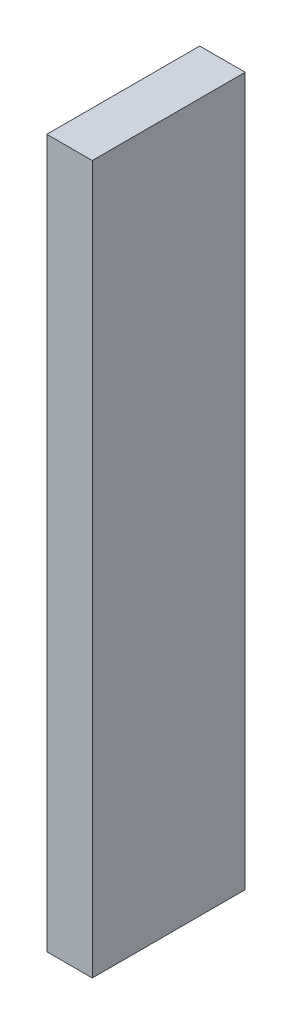
ISO-10303-21;
HEADER;
FILE_DESCRIPTION(('STEP AP214'),'2;1');
FILE_NAME('part.step','',(''),(''),'','','');
FILE_SCHEMA(('AUTOMOTIVE_DESIGN { 1 0 10303 214 1 1 1 1 }'));
ENDSEC;
DATA;
#1=APPLICATION_CONTEXT('core data for automotive mechanical design processes');
#2=APPLICATION_PROTOCOL_DEFINITION('international standard','automotive_design',2000,#1);
#3=PRODUCT_CONTEXT('',#1,'mechanical');
#4=PRODUCT('Part','Part','',(#3));
#5=PRODUCT_RELATED_PRODUCT_CATEGORY('part','',(#4));
#6=PRODUCT_DEFINITION_FORMATION('','',#4);
#7=PRODUCT_DEFINITION_CONTEXT('part definition',#1,'design');
#8=PRODUCT_DEFINITION('design','',#6,#7);
#9=PRODUCT_DEFINITION_SHAPE('','',#8);
#10=(LENGTH_UNIT() NAMED_UNIT(*) SI_UNIT(.MILLI.,.METRE.));
#11=(NAMED_UNIT(*) PLANE_ANGLE_UNIT() SI_UNIT($,.RADIAN.));
#12=(NAMED_UNIT(*) SI_UNIT($,.STERADIAN.) SOLID_ANGLE_UNIT());
#13=UNCERTAINTY_MEASURE_WITH_UNIT(LENGTH_MEASURE(1.E-05),#10,'distance_accuracy_value','');
#14=(GEOMETRIC_REPRESENTATION_CONTEXT(3) GLOBAL_UNCERTAINTY_ASSIGNED_CONTEXT((#13)) GLOBAL_UNIT_ASSIGNED_CONTEXT((#10,
#11,#12)) REPRESENTATION_CONTEXT('',''));
#15=CARTESIAN_POINT('',(0.,0.,0.));
#16=DIRECTION('',(0.,0.,1.));
#17=DIRECTION('',(1.,0.,0.));
#18=AXIS2_PLACEMENT_3D('',#15,#16,#17);
#19=CARTESIAN_POINT('',(130.275545246328,22.4180708263693,66.072028202897));
#20=DIRECTION('',(-1.69244514382854E-09,0.,1.));
#21=DIRECTION('',(1.,0.,1.69244514382854E-09));
#22=AXIS2_PLACEMENT_3D('',#19,#20,#21);
#23=PLANE('',#22);
#24=DIRECTION('',(0.,-1.,0.));
#25=VECTOR('',#24,1.);
#26=CARTESIAN_POINT('',(131.258630343341,22.4180708263693,66.0720282045608));
#27=LINE('',#26,#25);
#28=CARTESIAN_POINT('',(131.258630343341,22.4180708263693,66.0720282045608));
#29=VERTEX_POINT('',#28);
#30=CARTESIAN_POINT('',(131.258630343341,7.11212965552236,66.0720282045608));
#31=VERTEX_POINT('',#30);
#32=EDGE_CURVE('E79',#29,#31,#27,.T.);
#33=ORIENTED_EDGE('',*,*,#32,.F.);
#34=DIRECTION('',(1.,0.,1.69244514382854E-09));
#35=VECTOR('',#34,1.);
#36=CARTESIAN_POINT('',(130.275545246328,22.4180708263693,66.072028202897));
#37=LINE('',#36,#35);
#38=CARTESIAN_POINT('',(130.275545246328,22.4180708263693,66.072028202897));
#39=VERTEX_POINT('',#38);
#40=EDGE_CURVE('E32',#39,#29,#37,.T.);
#41=ORIENTED_EDGE('',*,*,#40,.F.);
#42=DIRECTION('',(0.,-1.,0.));
#43=VECTOR('',#42,1.);
#44=CARTESIAN_POINT('',(130.275545246328,22.4180708263693,66.072028202897));
#45=LINE('',#44,#43);
#46=CARTESIAN_POINT('',(130.275545246328,7.11212965552236,66.0720282028969));
#47=VERTEX_POINT('',#46);
#48=EDGE_CURVE('E71',#39,#47,#45,.T.);
#49=ORIENTED_EDGE('',*,*,#48,.T.);
#50=DIRECTION('',(1.,0.,1.69244514382854E-09));
#51=VECTOR('',#50,1.);
#52=CARTESIAN_POINT('',(130.275545246328,7.11212965552236,66.0720282028969));
#53=LINE('',#52,#51);
#54=EDGE_CURVE('E10',#47,#31,#53,.T.);
#55=ORIENTED_EDGE('',*,*,#54,.T.);
#56=EDGE_LOOP('',(#33,#41,#49,#55));
#57=FACE_BOUND('',#56,.T.);
#58=ADVANCED_FACE('F16',(#57),#23,.T.);
#59=CARTESIAN_POINT('',(130.275545246328,7.11212965552236,66.0720282028969));
#60=DIRECTION('',(0.,-1.,0.));
#61=DIRECTION('',(0.,0.,-1.));
#62=AXIS2_PLACEMENT_3D('',#59,#60,#61);
#63=PLANE('',#62);
#64=DIRECTION('',(1.69244514382854E-09,0.,-1.));
#65=VECTOR('',#64,1.);
#66=CARTESIAN_POINT('',(131.258630343341,7.11212965552236,66.0720282045608));
#67=LINE('',#66,#65);
#68=CARTESIAN_POINT('',(131.258630348936,7.11212965552235,62.766087033712));
#69=VERTEX_POINT('',#68);
#70=EDGE_CURVE('E82',#31,#69,#67,.T.);
#71=ORIENTED_EDGE('',*,*,#70,.F.);
#72=ORIENTED_EDGE('',*,*,#54,.F.);
#73=DIRECTION('',(1.69244514382854E-09,0.,-1.));
#74=VECTOR('',#73,1.);
#75=CARTESIAN_POINT('',(130.275545246328,7.11212965552236,66.0720282028969));
#76=LINE('',#75,#74);
#77=CARTESIAN_POINT('',(130.275545251923,7.11212965552235,62.7660870320482));
#78=VERTEX_POINT('',#77);
#79=EDGE_CURVE('E67',#47,#78,#76,.T.);
#80=ORIENTED_EDGE('',*,*,#79,.T.);
#81=DIRECTION('',(1.,0.,1.69244514382854E-09));
#82=VECTOR('',#81,1.);
#83=CARTESIAN_POINT('',(130.275545251923,7.11212965552235,62.7660870320482));
#84=LINE('',#83,#82);
#85=EDGE_CURVE('E24',#78,#69,#84,.T.);
#86=ORIENTED_EDGE('',*,*,#85,.T.);
#87=EDGE_LOOP('',(#71,#72,#80,#86));
#88=FACE_BOUND('',#87,.T.);
#89=ADVANCED_FACE('F68',(#88),#63,.T.);
#90=CARTESIAN_POINT('',(130.275545251923,7.11212965552235,62.7660870320482));
#91=DIRECTION('',(1.69244514382854E-09,0.,-1.));
#92=DIRECTION('',(-1.,0.,-1.69244514382854E-09));
#93=AXIS2_PLACEMENT_3D('',#90,#91,#92);
#94=PLANE('',#93);
#95=DIRECTION('',(0.,1.,0.));
#96=VECTOR('',#95,1.);
#97=CARTESIAN_POINT('',(131.258630348936,7.11212965552235,62.766087033712));
#98=LINE('',#97,#96);
#99=CARTESIAN_POINT('',(131.258630348936,22.418070826371,62.7660870252515));
#100=VERTEX_POINT('',#99);
#101=EDGE_CURVE('E65',#69,#100,#98,.T.);
#102=ORIENTED_EDGE('',*,*,#101,.F.);
#103=ORIENTED_EDGE('',*,*,#85,.F.);
#104=DIRECTION('',(0.,1.,0.));
#105=VECTOR('',#104,1.);
#106=CARTESIAN_POINT('',(130.275545251923,7.11212965552235,62.7660870320482));
#107=LINE('',#106,#105);
#108=CARTESIAN_POINT('',(130.275545251923,22.418070826371,62.7660870235876));
#109=VERTEX_POINT('',#108);
#110=EDGE_CURVE('E62',#78,#109,#107,.T.);
#111=ORIENTED_EDGE('',*,*,#110,.T.);
#112=DIRECTION('',(1.,0.,1.69244514382854E-09));
#113=VECTOR('',#112,1.);
#114=CARTESIAN_POINT('',(130.275545251923,22.418070826371,62.7660870235876));
#115=LINE('',#114,#113);
#116=EDGE_CURVE('E48',#109,#100,#115,.T.);
#117=ORIENTED_EDGE('',*,*,#116,.T.);
#118=EDGE_LOOP('',(#102,#103,#111,#117));
#119=FACE_BOUND('',#118,.T.);
#120=ADVANCED_FACE('F60',(#119),#94,.T.);
#121=CARTESIAN_POINT('',(130.275545251923,22.418070826371,62.7660870235876));
#122=DIRECTION('',(0.,1.,0.));
#123=DIRECTION('',(-1.,0.,0.));
#124=AXIS2_PLACEMENT_3D('',#121,#122,#123);
#125=PLANE('',#124);
#126=DIRECTION('',(-1.69244514382854E-09,0.,1.));
#127=VECTOR('',#126,1.);
#128=CARTESIAN_POINT('',(131.258630348936,22.418070826371,62.7660870252515));
#129=LINE('',#128,#127);
#130=EDGE_CURVE('E85',#100,#29,#129,.T.);
#131=ORIENTED_EDGE('',*,*,#130,.F.);
#132=ORIENTED_EDGE('',*,*,#116,.F.);
#133=DIRECTION('',(-1.69244514382854E-09,0.,1.));
#134=VECTOR('',#133,1.);
#135=CARTESIAN_POINT('',(130.275545251923,22.418070826371,62.7660870235876));
#136=LINE('',#135,#134);
#137=EDGE_CURVE('E74',#109,#39,#136,.T.);
#138=ORIENTED_EDGE('',*,*,#137,.T.);
#139=ORIENTED_EDGE('',*,*,#40,.T.);
#140=EDGE_LOOP('',(#131,#132,#138,#139));
#141=FACE_BOUND('',#140,.T.);
#142=ADVANCED_FACE('F96',(#141),#125,.T.);
#143=CARTESIAN_POINT('',(130.275545201028,17.2651002409467,92.8378644340291));
#144=DIRECTION('',(1.,0.,1.69244514382854E-09));
#145=DIRECTION('',(0.,1.,0.));
#146=AXIS2_PLACEMENT_3D('',#143,#144,#145);
#147=PLANE('',#146);
#148=ORIENTED_EDGE('',*,*,#48,.F.);
#149=ORIENTED_EDGE('',*,*,#137,.F.);
#150=ORIENTED_EDGE('',*,*,#110,.F.);
#151=ORIENTED_EDGE('',*,*,#79,.F.);
#152=EDGE_LOOP('',(#148,#149,#150,#151));
#153=FACE_BOUND('',#152,.T.);
#154=ADVANCED_FACE('F73',(#153),#147,.F.);
#155=CARTESIAN_POINT('',(131.258630298041,17.2651002409467,92.8378644356929));
#156=DIRECTION('',(1.,0.,1.69244514382854E-09));
#157=DIRECTION('',(0.,1.,0.));
#158=AXIS2_PLACEMENT_3D('',#155,#156,#157);
#159=PLANE('',#158);
#160=ORIENTED_EDGE('',*,*,#32,.T.);
#161=ORIENTED_EDGE('',*,*,#70,.T.);
#162=ORIENTED_EDGE('',*,*,#101,.T.);
#163=ORIENTED_EDGE('',*,*,#130,.T.);
#164=EDGE_LOOP('',(#160,#161,#162,#163));
#165=FACE_BOUND('',#164,.T.);
#166=ADVANCED_FACE('F89',(#165),#159,.T.);
#167=CLOSED_SHELL('',(#58,#89,#120,#142,#154,#166));
#168=MANIFOLD_SOLID_BREP('B1',#167);
#169=ADVANCED_BREP_SHAPE_REPRESENTATION('',(#18,#168),#14);
#170=SHAPE_DEFINITION_REPRESENTATION(#9,#169);
ENDSEC;
END-ISO-10303-21;
